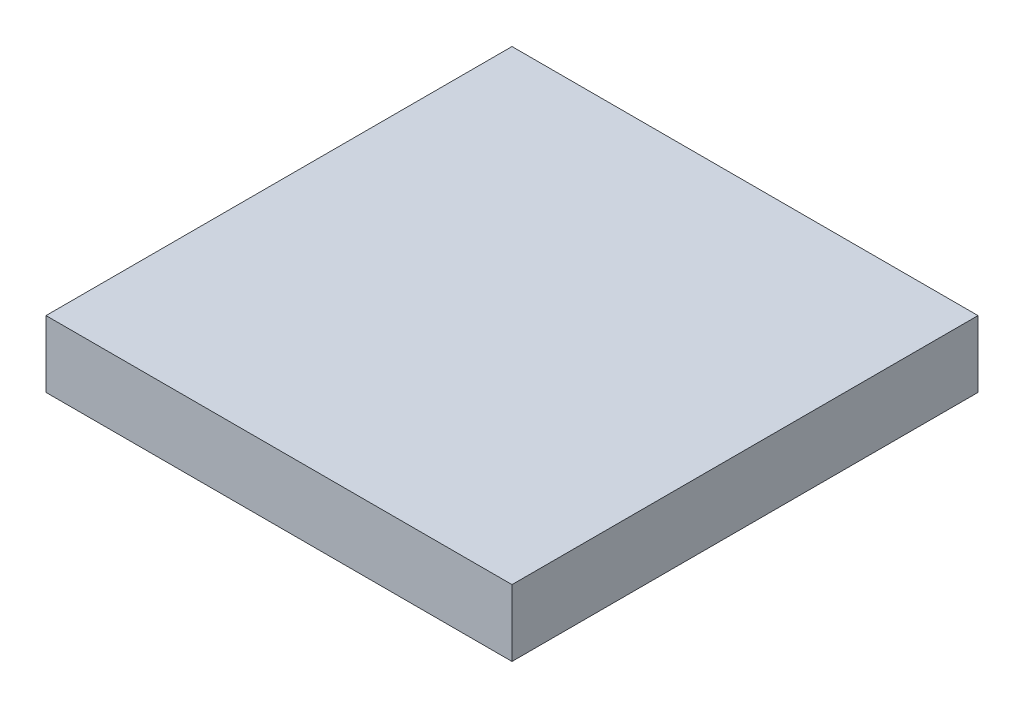
ISO-10303-21;
HEADER;
FILE_DESCRIPTION(('STEP AP214'),'2;1');
FILE_NAME('part.step','',(''),(''),'','','');
FILE_SCHEMA(('AUTOMOTIVE_DESIGN { 1 0 10303 214 1 1 1 1 }'));
ENDSEC;
DATA;
#1=APPLICATION_CONTEXT('core data for automotive mechanical design processes');
#2=APPLICATION_PROTOCOL_DEFINITION('international standard','automotive_design',2000,#1);
#3=PRODUCT_CONTEXT('',#1,'mechanical');
#4=PRODUCT('Part','Part','',(#3));
#5=PRODUCT_RELATED_PRODUCT_CATEGORY('part','',(#4));
#6=PRODUCT_DEFINITION_FORMATION('','',#4);
#7=PRODUCT_DEFINITION_CONTEXT('part definition',#1,'design');
#8=PRODUCT_DEFINITION('design','',#6,#7);
#9=PRODUCT_DEFINITION_SHAPE('','',#8);
#10=(LENGTH_UNIT() NAMED_UNIT(*) SI_UNIT(.MILLI.,.METRE.));
#11=(NAMED_UNIT(*) PLANE_ANGLE_UNIT() SI_UNIT($,.RADIAN.));
#12=(NAMED_UNIT(*) SI_UNIT($,.STERADIAN.) SOLID_ANGLE_UNIT());
#13=UNCERTAINTY_MEASURE_WITH_UNIT(LENGTH_MEASURE(1.E-05),#10,'distance_accuracy_value','');
#14=(GEOMETRIC_REPRESENTATION_CONTEXT(3) GLOBAL_UNCERTAINTY_ASSIGNED_CONTEXT((#13)) GLOBAL_UNIT_ASSIGNED_CONTEXT((#10,
#11,#12)) REPRESENTATION_CONTEXT('',''));
#15=CARTESIAN_POINT('',(0.,0.,0.));
#16=DIRECTION('',(0.,0.,1.));
#17=DIRECTION('',(1.,0.,0.));
#18=AXIS2_PLACEMENT_3D('',#15,#16,#17);
#19=CARTESIAN_POINT('',(-89.7427013987919,-50.,54.4575028942669));
#20=DIRECTION('',(-1.,0.,0.));
#21=DIRECTION('',(0.,0.,1.));
#22=AXIS2_PLACEMENT_3D('',#19,#20,#21);
#23=PLANE('',#22);
#24=DIRECTION('',(0.,0.,1.));
#25=VECTOR('',#24,1.);
#26=CARTESIAN_POINT('',(-89.7427013987919,0.,54.4575028942669));
#27=LINE('',#26,#25);
#28=CARTESIAN_POINT('',(-89.7427013987919,0.,-295.542497105733));
#29=VERTEX_POINT('',#28);
#30=CARTESIAN_POINT('',(-89.7427013987919,0.,54.4575028942669));
#31=VERTEX_POINT('',#30);
#32=EDGE_CURVE('E109',#29,#31,#27,.T.);
#33=ORIENTED_EDGE('',*,*,#32,.F.);
#34=DIRECTION('',(0.,1.,0.));
#35=VECTOR('',#34,1.);
#36=CARTESIAN_POINT('',(-89.7427013987919,-50.,-295.542497105733));
#37=LINE('',#36,#35);
#38=CARTESIAN_POINT('',(-89.7427013987919,-50.,-295.542497105733));
#39=VERTEX_POINT('',#38);
#40=EDGE_CURVE('E11',#39,#29,#37,.T.);
#41=ORIENTED_EDGE('',*,*,#40,.F.);
#42=DIRECTION('',(0.,0.,1.));
#43=VECTOR('',#42,1.);
#44=CARTESIAN_POINT('',(-89.7427013987919,-50.,54.4575028942669));
#45=LINE('',#44,#43);
#46=CARTESIAN_POINT('',(-89.7427013987919,-50.,54.4575028942669));
#47=VERTEX_POINT('',#46);
#48=EDGE_CURVE('E101',#39,#47,#45,.T.);
#49=ORIENTED_EDGE('',*,*,#48,.T.);
#50=DIRECTION('',(0.,1.,0.));
#51=VECTOR('',#50,1.);
#52=CARTESIAN_POINT('',(-89.7427013987919,-50.,54.4575028942669));
#53=LINE('',#52,#51);
#54=EDGE_CURVE('E42',#47,#31,#53,.T.);
#55=ORIENTED_EDGE('',*,*,#54,.T.);
#56=EDGE_LOOP('',(#33,#41,#49,#55));
#57=FACE_BOUND('',#56,.T.);
#58=ADVANCED_FACE('F39',(#57),#23,.T.);
#59=CARTESIAN_POINT('',(-89.7427013987919,-50.,-295.542497105733));
#60=DIRECTION('',(0.,0.,-1.));
#61=DIRECTION('',(-1.,0.,0.));
#62=AXIS2_PLACEMENT_3D('',#59,#60,#61);
#63=PLANE('',#62);
#64=DIRECTION('',(-1.,0.,0.));
#65=VECTOR('',#64,1.);
#66=CARTESIAN_POINT('',(-89.7427013987919,0.,-295.542497105733));
#67=LINE('',#66,#65);
#68=CARTESIAN_POINT('',(260.257298601208,0.,-295.542497105733));
#69=VERTEX_POINT('',#68);
#70=EDGE_CURVE('E104',#69,#29,#67,.T.);
#71=ORIENTED_EDGE('',*,*,#70,.F.);
#72=DIRECTION('',(0.,1.,0.));
#73=VECTOR('',#72,1.);
#74=CARTESIAN_POINT('',(260.257298601208,-50.,-295.542497105733));
#75=LINE('',#74,#73);
#76=CARTESIAN_POINT('',(260.257298601208,-50.,-295.542497105733));
#77=VERTEX_POINT('',#76);
#78=EDGE_CURVE('E49',#77,#69,#75,.T.);
#79=ORIENTED_EDGE('',*,*,#78,.F.);
#80=DIRECTION('',(-1.,0.,0.));
#81=VECTOR('',#80,1.);
#82=CARTESIAN_POINT('',(-89.7427013987919,-50.,-295.542497105733));
#83=LINE('',#82,#81);
#84=EDGE_CURVE('E96',#77,#39,#83,.T.);
#85=ORIENTED_EDGE('',*,*,#84,.T.);
#86=ORIENTED_EDGE('',*,*,#40,.T.);
#87=EDGE_LOOP('',(#71,#79,#85,#86));
#88=FACE_BOUND('',#87,.T.);
#89=ADVANCED_FACE('F125',(#88),#63,.T.);
#90=CARTESIAN_POINT('',(260.257298601208,-50.,54.4575028942669));
#91=DIRECTION('',(1.,0.,0.));
#92=DIRECTION('',(0.,0.,-1.));
#93=AXIS2_PLACEMENT_3D('',#90,#91,#92);
#94=PLANE('',#93);
#95=DIRECTION('',(0.,0.,-1.));
#96=VECTOR('',#95,1.);
#97=CARTESIAN_POINT('',(260.257298601208,0.,54.4575028942669));
#98=LINE('',#97,#96);
#99=CARTESIAN_POINT('',(260.257298601208,0.,54.4575028942669));
#100=VERTEX_POINT('',#99);
#101=EDGE_CURVE('E90',#100,#69,#98,.T.);
#102=ORIENTED_EDGE('',*,*,#101,.F.);
#103=DIRECTION('',(0.,1.,0.));
#104=VECTOR('',#103,1.);
#105=CARTESIAN_POINT('',(260.257298601208,-50.,54.4575028942669));
#106=LINE('',#105,#104);
#107=CARTESIAN_POINT('',(260.257298601208,-50.,54.4575028942669));
#108=VERTEX_POINT('',#107);
#109=EDGE_CURVE('E85',#108,#100,#106,.T.);
#110=ORIENTED_EDGE('',*,*,#109,.F.);
#111=DIRECTION('',(0.,0.,-1.));
#112=VECTOR('',#111,1.);
#113=CARTESIAN_POINT('',(260.257298601208,-50.,54.4575028942669));
#114=LINE('',#113,#112);
#115=EDGE_CURVE('E88',#108,#77,#114,.T.);
#116=ORIENTED_EDGE('',*,*,#115,.T.);
#117=ORIENTED_EDGE('',*,*,#78,.T.);
#118=EDGE_LOOP('',(#102,#110,#116,#117));
#119=FACE_BOUND('',#118,.T.);
#120=ADVANCED_FACE('F87',(#119),#94,.T.);
#121=CARTESIAN_POINT('',(-89.7427013987919,-50.,54.4575028942669));
#122=DIRECTION('',(0.,0.,1.));
#123=DIRECTION('',(1.,0.,0.));
#124=AXIS2_PLACEMENT_3D('',#121,#122,#123);
#125=PLANE('',#124);
#126=DIRECTION('',(1.,0.,0.));
#127=VECTOR('',#126,1.);
#128=CARTESIAN_POINT('',(-89.7427013987919,0.,54.4575028942669));
#129=LINE('',#128,#127);
#130=EDGE_CURVE('E113',#31,#100,#129,.T.);
#131=ORIENTED_EDGE('',*,*,#130,.F.);
#132=ORIENTED_EDGE('',*,*,#54,.F.);
#133=DIRECTION('',(1.,0.,0.));
#134=VECTOR('',#133,1.);
#135=CARTESIAN_POINT('',(-89.7427013987919,-50.,54.4575028942669));
#136=LINE('',#135,#134);
#137=EDGE_CURVE('E95',#47,#108,#136,.T.);
#138=ORIENTED_EDGE('',*,*,#137,.T.);
#139=ORIENTED_EDGE('',*,*,#109,.T.);
#140=EDGE_LOOP('',(#131,#132,#138,#139));
#141=FACE_BOUND('',#140,.T.);
#142=ADVANCED_FACE('F99',(#141),#125,.T.);
#143=CARTESIAN_POINT('',(0.,-50.,0.));
#144=DIRECTION('',(0.,-1.,0.));
#145=DIRECTION('',(0.,0.,-1.));
#146=AXIS2_PLACEMENT_3D('',#143,#144,#145);
#147=PLANE('',#146);
#148=ORIENTED_EDGE('',*,*,#48,.F.);
#149=ORIENTED_EDGE('',*,*,#84,.F.);
#150=ORIENTED_EDGE('',*,*,#115,.F.);
#151=ORIENTED_EDGE('',*,*,#137,.F.);
#152=EDGE_LOOP('',(#148,#149,#150,#151));
#153=FACE_BOUND('',#152,.T.);
#154=ADVANCED_FACE('F94',(#153),#147,.T.);
#155=CARTESIAN_POINT('',(0.,0.,0.));
#156=DIRECTION('',(0.,-1.,0.));
#157=DIRECTION('',(0.,0.,-1.));
#158=AXIS2_PLACEMENT_3D('',#155,#156,#157);
#159=PLANE('',#158);
#160=ORIENTED_EDGE('',*,*,#32,.T.);
#161=ORIENTED_EDGE('',*,*,#130,.T.);
#162=ORIENTED_EDGE('',*,*,#101,.T.);
#163=ORIENTED_EDGE('',*,*,#70,.T.);
#164=EDGE_LOOP('',(#160,#161,#162,#163));
#165=FACE_BOUND('',#164,.T.);
#166=ADVANCED_FACE('F124',(#165),#159,.F.);
#167=CLOSED_SHELL('',(#58,#89,#120,#142,#154,#166));
#168=MANIFOLD_SOLID_BREP('B2',#167);
#169=ADVANCED_BREP_SHAPE_REPRESENTATION('',(#18,#168),#14);
#170=SHAPE_DEFINITION_REPRESENTATION(#9,#169);
ENDSEC;
END-ISO-10303-21;
